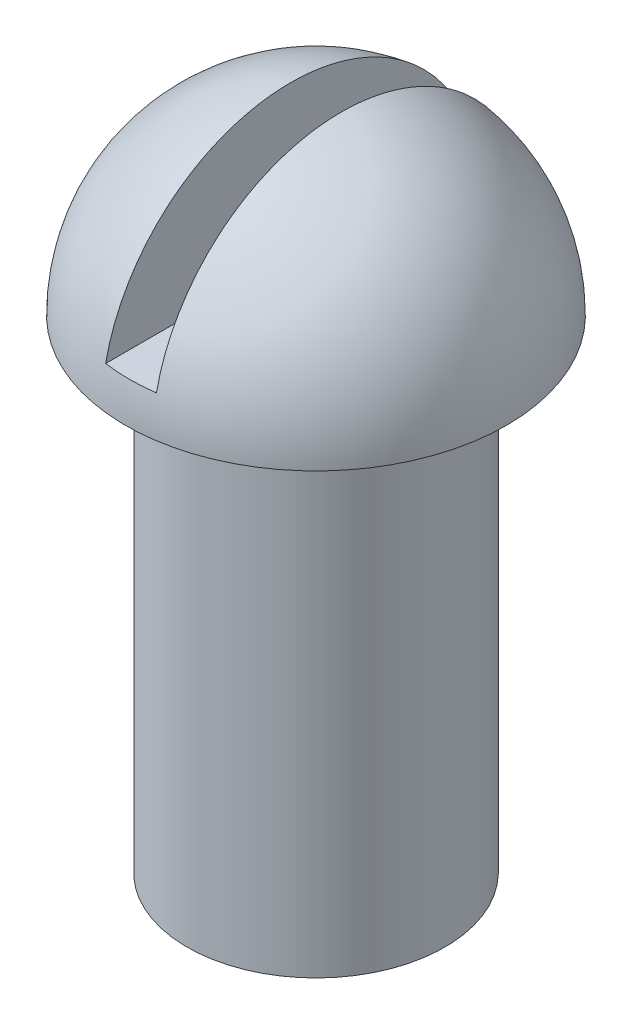
ISO-10303-21;
HEADER;
FILE_DESCRIPTION(('STEP AP214'),'2;1');
FILE_NAME('part.step','',(''),(''),'','','');
FILE_SCHEMA(('AUTOMOTIVE_DESIGN { 1 0 10303 214 1 1 1 1 }'));
ENDSEC;
DATA;
#1=APPLICATION_CONTEXT('core data for automotive mechanical design processes');
#2=APPLICATION_PROTOCOL_DEFINITION('international standard','automotive_design',2000,#1);
#3=PRODUCT_CONTEXT('',#1,'mechanical');
#4=PRODUCT('Part','Part','',(#3));
#5=PRODUCT_RELATED_PRODUCT_CATEGORY('part','',(#4));
#6=PRODUCT_DEFINITION_FORMATION('','',#4);
#7=PRODUCT_DEFINITION_CONTEXT('part definition',#1,'design');
#8=PRODUCT_DEFINITION('design','',#6,#7);
#9=PRODUCT_DEFINITION_SHAPE('','',#8);
#10=(LENGTH_UNIT() NAMED_UNIT(*) SI_UNIT(.MILLI.,.METRE.));
#11=(NAMED_UNIT(*) PLANE_ANGLE_UNIT() SI_UNIT($,.RADIAN.));
#12=(NAMED_UNIT(*) SI_UNIT($,.STERADIAN.) SOLID_ANGLE_UNIT());
#13=UNCERTAINTY_MEASURE_WITH_UNIT(LENGTH_MEASURE(1.E-05),#10,'distance_accuracy_value','');
#14=(GEOMETRIC_REPRESENTATION_CONTEXT(3) GLOBAL_UNCERTAINTY_ASSIGNED_CONTEXT((#13)) GLOBAL_UNIT_ASSIGNED_CONTEXT((#10,
#11,#12)) REPRESENTATION_CONTEXT('',''));
#15=CARTESIAN_POINT('',(0.,0.,0.));
#16=DIRECTION('',(0.,0.,1.));
#17=DIRECTION('',(1.,0.,0.));
#18=AXIS2_PLACEMENT_3D('',#15,#16,#17);
#19=CARTESIAN_POINT('',(0.,38.,0.));
#20=DIRECTION('',(0.,1.,0.));
#21=DIRECTION('',(1.,0.,0.));
#22=AXIS2_PLACEMENT_3D('',#19,#20,#21);
#23=SPHERICAL_SURFACE('',#22,15.);
#24=CARTESIAN_POINT('',(2.,38.,0.));
#25=DIRECTION('',(1.,0.,0.));
#26=DIRECTION('',(0.,1.,0.));
#27=AXIS2_PLACEMENT_3D('',#24,#25,#26);
#28=CIRCLE('',#27,14.8660687473185);
#29=CARTESIAN_POINT('',(2.,41.,-14.560219778561));
#30=VERTEX_POINT('',#29);
#31=CARTESIAN_POINT('',(2.,41.,14.560219778561));
#32=VERTEX_POINT('',#31);
#33=EDGE_CURVE('E77',#30,#32,#28,.T.);
#34=ORIENTED_EDGE('',*,*,#33,.T.);
#35=CARTESIAN_POINT('',(0.,41.,0.));
#36=DIRECTION('',(0.,-1.,0.));
#37=DIRECTION('',(0.,0.,-1.));
#38=AXIS2_PLACEMENT_3D('',#35,#36,#37);
#39=CIRCLE('',#38,14.6969384566991);
#40=CARTESIAN_POINT('',(-2.,41.,14.560219778561));
#41=VERTEX_POINT('',#40);
#42=EDGE_CURVE('E11',#32,#41,#39,.T.);
#43=ORIENTED_EDGE('',*,*,#42,.T.);
#44=CARTESIAN_POINT('',(-2.,38.,0.));
#45=DIRECTION('',(-1.,0.,0.));
#46=DIRECTION('',(0.,-1.,0.));
#47=AXIS2_PLACEMENT_3D('',#44,#45,#46);
#48=CIRCLE('',#47,14.8660687473185);
#49=CARTESIAN_POINT('',(-2.,41.,-14.560219778561));
#50=VERTEX_POINT('',#49);
#51=EDGE_CURVE('E46',#41,#50,#48,.T.);
#52=ORIENTED_EDGE('',*,*,#51,.T.);
#53=EDGE_CURVE('E53',#50,#30,#39,.T.);
#54=ORIENTED_EDGE('',*,*,#53,.T.);
#55=EDGE_LOOP('',(#34,#43,#52,#54));
#56=FACE_BOUND('',#55,.T.);
#57=CARTESIAN_POINT('',(0.,38.,0.));
#58=DIRECTION('',(0.,1.,0.));
#59=DIRECTION('',(-1.,0.,0.));
#60=AXIS2_PLACEMENT_3D('',#57,#58,#59);
#61=CIRCLE('',#60,15.);
#62=CARTESIAN_POINT('',(-15.,38.,0.));
#63=VERTEX_POINT('',#62);
#64=EDGE_CURVE('E80',#63,#63,#61,.T.);
#65=ORIENTED_EDGE('',*,*,#64,.T.);
#66=EDGE_LOOP('',(#65));
#67=FACE_BOUND('',#66,.T.);
#68=ADVANCED_FACE('F43',(#56,#67),#23,.T.);
#69=CARTESIAN_POINT('',(0.,0.,0.));
#70=DIRECTION('',(0.,1.,0.));
#71=DIRECTION('',(-1.,0.,0.));
#72=AXIS2_PLACEMENT_3D('',#69,#70,#71);
#73=PLANE('',#72);
#74=CARTESIAN_POINT('',(0.,0.,0.));
#75=DIRECTION('',(0.,1.,0.));
#76=DIRECTION('',(-1.,0.,0.));
#77=AXIS2_PLACEMENT_3D('',#74,#75,#76);
#78=CIRCLE('',#77,10.15);
#79=CARTESIAN_POINT('',(-10.15,0.,0.));
#80=VERTEX_POINT('',#79);
#81=EDGE_CURVE('E86',#80,#80,#78,.T.);
#82=ORIENTED_EDGE('',*,*,#81,.F.);
#83=EDGE_LOOP('',(#82));
#84=FACE_BOUND('',#83,.T.);
#85=ADVANCED_FACE('F111',(#84),#73,.F.);
#86=CARTESIAN_POINT('',(0.,53.,0.));
#87=DIRECTION('',(0.,1.,0.));
#88=DIRECTION('',(-1.,0.,0.));
#89=AXIS2_PLACEMENT_3D('',#86,#87,#88);
#90=CYLINDRICAL_SURFACE('',#89,10.15);
#91=CARTESIAN_POINT('',(0.,38.,0.));
#92=DIRECTION('',(0.,1.,0.));
#93=DIRECTION('',(-1.,0.,0.));
#94=AXIS2_PLACEMENT_3D('',#91,#92,#93);
#95=CIRCLE('',#94,10.15);
#96=CARTESIAN_POINT('',(-10.15,38.,0.));
#97=VERTEX_POINT('',#96);
#98=EDGE_CURVE('E91',#97,#97,#95,.T.);
#99=ORIENTED_EDGE('',*,*,#98,.F.);
#100=EDGE_LOOP('',(#99));
#101=FACE_BOUND('',#100,.T.);
#102=ORIENTED_EDGE('',*,*,#81,.T.);
#103=EDGE_LOOP('',(#102));
#104=FACE_BOUND('',#103,.T.);
#105=ADVANCED_FACE('F105',(#101,#104),#90,.T.);
#106=CARTESIAN_POINT('',(10.15,38.,0.));
#107=DIRECTION('',(0.,1.,0.));
#108=DIRECTION('',(-1.,0.,0.));
#109=AXIS2_PLACEMENT_3D('',#106,#107,#108);
#110=PLANE('',#109);
#111=ORIENTED_EDGE('',*,*,#64,.F.);
#112=EDGE_LOOP('',(#111));
#113=FACE_BOUND('',#112,.T.);
#114=ORIENTED_EDGE('',*,*,#98,.T.);
#115=EDGE_LOOP('',(#114));
#116=FACE_BOUND('',#115,.T.);
#117=ADVANCED_FACE('F101',(#113,#116),#110,.F.);
#118=CARTESIAN_POINT('',(-2.,61.3251546344922,-15.));
#119=DIRECTION('',(-1.,0.,0.));
#120=DIRECTION('',(0.,-1.,0.));
#121=AXIS2_PLACEMENT_3D('',#118,#119,#120);
#122=PLANE('',#121);
#123=DIRECTION('',(0.,0.,1.));
#124=VECTOR('',#123,1.);
#125=CARTESIAN_POINT('',(-2.,41.,-15.));
#126=LINE('',#125,#124);
#127=EDGE_CURVE('E72',#50,#41,#126,.T.);
#128=ORIENTED_EDGE('',*,*,#127,.F.);
#129=ORIENTED_EDGE('',*,*,#51,.F.);
#130=EDGE_LOOP('',(#128,#129));
#131=FACE_BOUND('',#130,.T.);
#132=ADVANCED_FACE('F104',(#131),#122,.F.);
#133=CARTESIAN_POINT('',(2.,61.3251546344922,-15.));
#134=DIRECTION('',(1.,0.,0.));
#135=DIRECTION('',(0.,1.,0.));
#136=AXIS2_PLACEMENT_3D('',#133,#134,#135);
#137=PLANE('',#136);
#138=DIRECTION('',(0.,0.,1.));
#139=VECTOR('',#138,1.);
#140=CARTESIAN_POINT('',(2.,41.,-15.));
#141=LINE('',#140,#139);
#142=EDGE_CURVE('E60',#30,#32,#141,.T.);
#143=ORIENTED_EDGE('',*,*,#142,.T.);
#144=ORIENTED_EDGE('',*,*,#33,.F.);
#145=EDGE_LOOP('',(#143,#144));
#146=FACE_BOUND('',#145,.T.);
#147=ADVANCED_FACE('F76',(#146),#137,.F.);
#148=CARTESIAN_POINT('',(-2.,41.,-15.));
#149=DIRECTION('',(0.,-1.,0.));
#150=DIRECTION('',(0.,0.,-1.));
#151=AXIS2_PLACEMENT_3D('',#148,#149,#150);
#152=PLANE('',#151);
#153=ORIENTED_EDGE('',*,*,#142,.F.);
#154=ORIENTED_EDGE('',*,*,#53,.F.);
#155=ORIENTED_EDGE('',*,*,#127,.T.);
#156=ORIENTED_EDGE('',*,*,#42,.F.);
#157=EDGE_LOOP('',(#153,#154,#155,#156));
#158=FACE_BOUND('',#157,.T.);
#159=ADVANCED_FACE('F71',(#158),#152,.F.);
#160=CLOSED_SHELL('',(#68,#85,#105,#117,#132,#147,#159));
#161=MANIFOLD_SOLID_BREP('B2',#160);
#162=ADVANCED_BREP_SHAPE_REPRESENTATION('',(#18,#161),#14);
#163=SHAPE_DEFINITION_REPRESENTATION(#9,#162);
ENDSEC;
END-ISO-10303-21;
